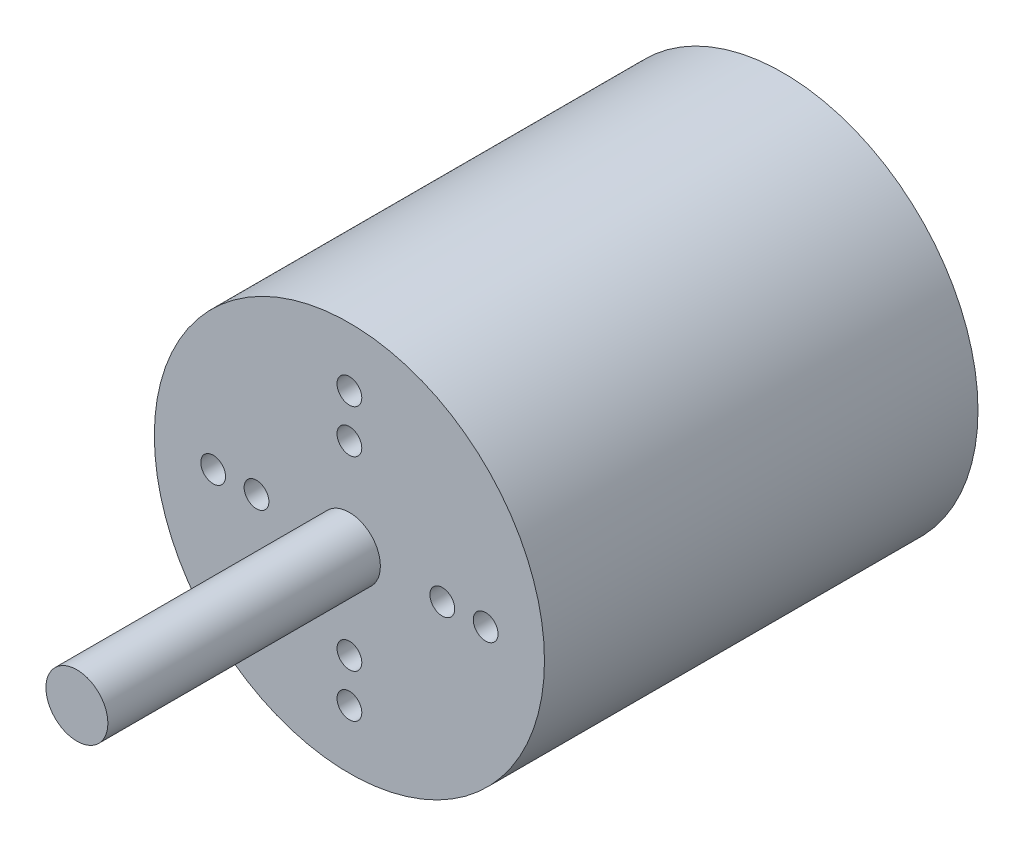
ISO-10303-21;
HEADER;
FILE_DESCRIPTION(('STEP AP214'),'2;1');
FILE_NAME('part.step','',(''),(''),'','','');
FILE_SCHEMA(('AUTOMOTIVE_DESIGN { 1 0 10303 214 1 1 1 1 }'));
ENDSEC;
DATA;
#1=APPLICATION_CONTEXT('core data for automotive mechanical design processes');
#2=APPLICATION_PROTOCOL_DEFINITION('international standard','automotive_design',2000,#1);
#3=PRODUCT_CONTEXT('',#1,'mechanical');
#4=PRODUCT('Part','Part','',(#3));
#5=PRODUCT_RELATED_PRODUCT_CATEGORY('part','',(#4));
#6=PRODUCT_DEFINITION_FORMATION('','',#4);
#7=PRODUCT_DEFINITION_CONTEXT('part definition',#1,'design');
#8=PRODUCT_DEFINITION('design','',#6,#7);
#9=PRODUCT_DEFINITION_SHAPE('','',#8);
#10=(LENGTH_UNIT() NAMED_UNIT(*) SI_UNIT(.MILLI.,.METRE.));
#11=(NAMED_UNIT(*) PLANE_ANGLE_UNIT() SI_UNIT($,.RADIAN.));
#12=(NAMED_UNIT(*) SI_UNIT($,.STERADIAN.) SOLID_ANGLE_UNIT());
#13=UNCERTAINTY_MEASURE_WITH_UNIT(LENGTH_MEASURE(1.E-05),#10,'distance_accuracy_value','');
#14=(GEOMETRIC_REPRESENTATION_CONTEXT(3) GLOBAL_UNCERTAINTY_ASSIGNED_CONTEXT((#13)) GLOBAL_UNIT_ASSIGNED_CONTEXT((#10,
#11,#12)) REPRESENTATION_CONTEXT('',''));
#15=CARTESIAN_POINT('',(0.,0.,0.));
#16=DIRECTION('',(0.,0.,1.));
#17=DIRECTION('',(1.,0.,0.));
#18=AXIS2_PLACEMENT_3D('',#15,#16,#17);
#19=CARTESIAN_POINT('',(0.,0.,-70.));
#20=DIRECTION('',(0.,0.,1.));
#21=DIRECTION('',(1.,0.,0.));
#22=AXIS2_PLACEMENT_3D('',#19,#20,#21);
#23=CYLINDRICAL_SURFACE('',#22,31.5);
#24=CARTESIAN_POINT('',(0.,0.,-70.));
#25=DIRECTION('',(0.,0.,1.));
#26=DIRECTION('',(1.,0.,0.));
#27=AXIS2_PLACEMENT_3D('',#24,#25,#26);
#28=CIRCLE('',#27,31.5);
#29=CARTESIAN_POINT('',(31.5,0.,-70.));
#30=VERTEX_POINT('',#29);
#31=EDGE_CURVE('E45',#30,#30,#28,.T.);
#32=ORIENTED_EDGE('',*,*,#31,.T.);
#33=EDGE_LOOP('',(#32));
#34=FACE_BOUND('',#33,.T.);
#35=CARTESIAN_POINT('',(0.,0.,0.));
#36=DIRECTION('',(0.,0.,1.));
#37=DIRECTION('',(1.,0.,0.));
#38=AXIS2_PLACEMENT_3D('',#35,#36,#37);
#39=CIRCLE('',#38,31.5);
#40=CARTESIAN_POINT('',(31.5,0.,0.));
#41=VERTEX_POINT('',#40);
#42=EDGE_CURVE('E40',#41,#41,#39,.T.);
#43=ORIENTED_EDGE('',*,*,#42,.F.);
#44=EDGE_LOOP('',(#43));
#45=FACE_BOUND('',#44,.T.);
#46=ADVANCED_FACE('F37',(#34,#45),#23,.T.);
#47=CARTESIAN_POINT('',(0.,0.,-70.));
#48=DIRECTION('',(0.,0.,1.));
#49=DIRECTION('',(1.,0.,0.));
#50=AXIS2_PLACEMENT_3D('',#47,#48,#49);
#51=PLANE('',#50);
#52=CARTESIAN_POINT('',(0.,11.,-70.));
#53=DIRECTION('',(0.,0.,-1.));
#54=DIRECTION('',(0.,-1.,0.));
#55=AXIS2_PLACEMENT_3D('',#52,#53,#54);
#56=CIRCLE('',#55,2.);
#57=CARTESIAN_POINT('',(0.,9.,-70.));
#58=VERTEX_POINT('',#57);
#59=EDGE_CURVE('E145',#58,#58,#56,.T.);
#60=ORIENTED_EDGE('',*,*,#59,.F.);
#61=EDGE_LOOP('',(#60));
#62=FACE_BOUND('',#61,.T.);
#63=CARTESIAN_POINT('',(-11.,0.,-70.));
#64=DIRECTION('',(0.,0.,-1.));
#65=DIRECTION('',(1.,0.,0.));
#66=AXIS2_PLACEMENT_3D('',#63,#64,#65);
#67=CIRCLE('',#66,2.);
#68=CARTESIAN_POINT('',(-9.,0.,-70.));
#69=VERTEX_POINT('',#68);
#70=EDGE_CURVE('E137',#69,#69,#67,.T.);
#71=ORIENTED_EDGE('',*,*,#70,.F.);
#72=EDGE_LOOP('',(#71));
#73=FACE_BOUND('',#72,.T.);
#74=CARTESIAN_POINT('',(1.15218884181823E-13,-11.,-70.));
#75=DIRECTION('',(0.,0.,-1.));
#76=DIRECTION('',(0.,1.,0.));
#77=AXIS2_PLACEMENT_3D('',#74,#75,#76);
#78=CIRCLE('',#77,2.);
#79=CARTESIAN_POINT('',(0.,-9.,-70.));
#80=VERTEX_POINT('',#79);
#81=EDGE_CURVE('E129',#80,#80,#78,.T.);
#82=ORIENTED_EDGE('',*,*,#81,.F.);
#83=EDGE_LOOP('',(#82));
#84=FACE_BOUND('',#83,.T.);
#85=CARTESIAN_POINT('',(11.,0.,-70.));
#86=DIRECTION('',(0.,0.,-1.));
#87=DIRECTION('',(-1.,0.,0.));
#88=AXIS2_PLACEMENT_3D('',#85,#86,#87);
#89=CIRCLE('',#88,2.);
#90=CARTESIAN_POINT('',(9.,0.,-70.));
#91=VERTEX_POINT('',#90);
#92=EDGE_CURVE('E57',#91,#91,#89,.T.);
#93=ORIENTED_EDGE('',*,*,#92,.F.);
#94=EDGE_LOOP('',(#93));
#95=FACE_BOUND('',#94,.T.);
#96=ORIENTED_EDGE('',*,*,#31,.F.);
#97=EDGE_LOOP('',(#96));
#98=FACE_BOUND('',#97,.T.);
#99=ADVANCED_FACE('F162',(#62,#73,#84,#95,#98),#51,.F.);
#100=CARTESIAN_POINT('',(0.,0.,0.));
#101=DIRECTION('',(0.,0.,1.));
#102=DIRECTION('',(1.,0.,0.));
#103=AXIS2_PLACEMENT_3D('',#100,#101,#102);
#104=PLANE('',#103);
#105=CARTESIAN_POINT('',(22.,2.30437768363647E-13,0.));
#106=DIRECTION('',(0.,0.,1.));
#107=DIRECTION('',(0.,-1.,0.));
#108=AXIS2_PLACEMENT_3D('',#105,#106,#107);
#109=CIRCLE('',#108,2.);
#110=CARTESIAN_POINT('',(22.,-1.99999999999977,0.));
#111=VERTEX_POINT('',#110);
#112=EDGE_CURVE('E89',#111,#111,#109,.T.);
#113=ORIENTED_EDGE('',*,*,#112,.F.);
#114=EDGE_LOOP('',(#113));
#115=FACE_BOUND('',#114,.T.);
#116=CARTESIAN_POINT('',(-22.,0.,0.));
#117=DIRECTION('',(0.,0.,1.));
#118=DIRECTION('',(0.,1.,0.));
#119=AXIS2_PLACEMENT_3D('',#116,#117,#118);
#120=CIRCLE('',#119,2.);
#121=CARTESIAN_POINT('',(-22.,1.99999999999992,0.));
#122=VERTEX_POINT('',#121);
#123=EDGE_CURVE('E108',#122,#122,#120,.T.);
#124=ORIENTED_EDGE('',*,*,#123,.F.);
#125=EDGE_LOOP('',(#124));
#126=FACE_BOUND('',#125,.T.);
#127=CARTESIAN_POINT('',(0.,-15.,0.));
#128=DIRECTION('',(0.,0.,1.));
#129=DIRECTION('',(-1.,0.,0.));
#130=AXIS2_PLACEMENT_3D('',#127,#128,#129);
#131=CIRCLE('',#130,2.);
#132=CARTESIAN_POINT('',(-2.,-15.,0.));
#133=VERTEX_POINT('',#132);
#134=EDGE_CURVE('E99',#133,#133,#131,.T.);
#135=ORIENTED_EDGE('',*,*,#134,.F.);
#136=EDGE_LOOP('',(#135));
#137=FACE_BOUND('',#136,.T.);
#138=CARTESIAN_POINT('',(0.,-22.,0.));
#139=DIRECTION('',(0.,0.,1.));
#140=DIRECTION('',(-1.,0.,0.));
#141=AXIS2_PLACEMENT_3D('',#138,#139,#140);
#142=CIRCLE('',#141,2.);
#143=CARTESIAN_POINT('',(-2.,-22.,0.));
#144=VERTEX_POINT('',#143);
#145=EDGE_CURVE('E122',#144,#144,#142,.T.);
#146=ORIENTED_EDGE('',*,*,#145,.F.);
#147=EDGE_LOOP('',(#146));
#148=FACE_BOUND('',#147,.T.);
#149=CARTESIAN_POINT('',(15.,1.57116660247941E-13,0.));
#150=DIRECTION('',(0.,0.,1.));
#151=DIRECTION('',(0.,-1.,0.));
#152=AXIS2_PLACEMENT_3D('',#149,#150,#151);
#153=CIRCLE('',#152,2.);
#154=CARTESIAN_POINT('',(15.,-1.99999999999984,0.));
#155=VERTEX_POINT('',#154);
#156=EDGE_CURVE('E98',#155,#155,#153,.T.);
#157=ORIENTED_EDGE('',*,*,#156,.F.);
#158=EDGE_LOOP('',(#157));
#159=FACE_BOUND('',#158,.T.);
#160=CARTESIAN_POINT('',(-15.,0.,0.));
#161=DIRECTION('',(0.,0.,1.));
#162=DIRECTION('',(0.,1.,0.));
#163=AXIS2_PLACEMENT_3D('',#160,#161,#162);
#164=CIRCLE('',#163,2.);
#165=CARTESIAN_POINT('',(-15.,1.99999999999995,0.));
#166=VERTEX_POINT('',#165);
#167=EDGE_CURVE('E81',#166,#166,#164,.T.);
#168=ORIENTED_EDGE('',*,*,#167,.F.);
#169=EDGE_LOOP('',(#168));
#170=FACE_BOUND('',#169,.T.);
#171=CARTESIAN_POINT('',(0.,15.,0.));
#172=DIRECTION('',(0.,0.,1.));
#173=DIRECTION('',(1.,0.,0.));
#174=AXIS2_PLACEMENT_3D('',#171,#172,#173);
#175=CIRCLE('',#174,2.);
#176=CARTESIAN_POINT('',(2.,15.,0.));
#177=VERTEX_POINT('',#176);
#178=EDGE_CURVE('E74',#177,#177,#175,.T.);
#179=ORIENTED_EDGE('',*,*,#178,.F.);
#180=EDGE_LOOP('',(#179));
#181=FACE_BOUND('',#180,.T.);
#182=CARTESIAN_POINT('',(0.,22.,0.));
#183=DIRECTION('',(0.,0.,1.));
#184=DIRECTION('',(1.,0.,0.));
#185=AXIS2_PLACEMENT_3D('',#182,#183,#184);
#186=CIRCLE('',#185,2.);
#187=CARTESIAN_POINT('',(2.,22.,0.));
#188=VERTEX_POINT('',#187);
#189=EDGE_CURVE('E65',#188,#188,#186,.T.);
#190=ORIENTED_EDGE('',*,*,#189,.F.);
#191=EDGE_LOOP('',(#190));
#192=FACE_BOUND('',#191,.T.);
#193=CARTESIAN_POINT('',(0.,0.,0.));
#194=DIRECTION('',(0.,0.,1.));
#195=DIRECTION('',(1.,0.,0.));
#196=AXIS2_PLACEMENT_3D('',#193,#194,#195);
#197=CIRCLE('',#196,5.);
#198=CARTESIAN_POINT('',(5.,0.,0.));
#199=VERTEX_POINT('',#198);
#200=EDGE_CURVE('E10',#199,#199,#197,.T.);
#201=ORIENTED_EDGE('',*,*,#200,.F.);
#202=EDGE_LOOP('',(#201));
#203=FACE_BOUND('',#202,.T.);
#204=ORIENTED_EDGE('',*,*,#42,.T.);
#205=EDGE_LOOP('',(#204));
#206=FACE_BOUND('',#205,.T.);
#207=ADVANCED_FACE('F165',(#115,#126,#137,#148,#159,#170,#181,#192,#203,#206),#104,.T.);
#208=CARTESIAN_POINT('',(0.,0.,44.));
#209=DIRECTION('',(0.,0.,-1.));
#210=DIRECTION('',(-1.,0.,0.));
#211=AXIS2_PLACEMENT_3D('',#208,#209,#210);
#212=CYLINDRICAL_SURFACE('',#211,5.);
#213=CARTESIAN_POINT('',(0.,0.,44.));
#214=DIRECTION('',(0.,0.,1.));
#215=DIRECTION('',(1.,0.,0.));
#216=AXIS2_PLACEMENT_3D('',#213,#214,#215);
#217=CIRCLE('',#216,5.);
#218=CARTESIAN_POINT('',(5.,0.,44.));
#219=VERTEX_POINT('',#218);
#220=EDGE_CURVE('E52',#219,#219,#217,.T.);
#221=ORIENTED_EDGE('',*,*,#220,.F.);
#222=EDGE_LOOP('',(#221));
#223=FACE_BOUND('',#222,.T.);
#224=ORIENTED_EDGE('',*,*,#200,.T.);
#225=EDGE_LOOP('',(#224));
#226=FACE_BOUND('',#225,.T.);
#227=ADVANCED_FACE('F182',(#223,#226),#212,.T.);
#228=CARTESIAN_POINT('',(0.,0.,44.));
#229=DIRECTION('',(0.,0.,1.));
#230=DIRECTION('',(1.,0.,0.));
#231=AXIS2_PLACEMENT_3D('',#228,#229,#230);
#232=PLANE('',#231);
#233=ORIENTED_EDGE('',*,*,#220,.T.);
#234=EDGE_LOOP('',(#233));
#235=FACE_BOUND('',#234,.T.);
#236=ADVANCED_FACE('F187',(#235),#232,.T.);
#237=CARTESIAN_POINT('',(11.,0.,-60.));
#238=DIRECTION('',(0.,0.,-1.));
#239=DIRECTION('',(-1.,0.,0.));
#240=AXIS2_PLACEMENT_3D('',#237,#238,#239);
#241=CYLINDRICAL_SURFACE('',#240,2.);
#242=CARTESIAN_POINT('',(11.,0.,-60.));
#243=DIRECTION('',(0.,0.,-1.));
#244=DIRECTION('',(-1.,0.,0.));
#245=AXIS2_PLACEMENT_3D('',#242,#243,#244);
#246=CIRCLE('',#245,2.);
#247=CARTESIAN_POINT('',(9.,0.,-60.));
#248=VERTEX_POINT('',#247);
#249=EDGE_CURVE('E56',#248,#248,#246,.T.);
#250=ORIENTED_EDGE('',*,*,#249,.F.);
#251=EDGE_LOOP('',(#250));
#252=FACE_BOUND('',#251,.T.);
#253=ORIENTED_EDGE('',*,*,#92,.T.);
#254=EDGE_LOOP('',(#253));
#255=FACE_BOUND('',#254,.T.);
#256=ADVANCED_FACE('F195',(#252,#255),#241,.F.);
#257=CARTESIAN_POINT('',(11.,0.,-60.));
#258=DIRECTION('',(0.,0.,-1.));
#259=DIRECTION('',(-1.,0.,0.));
#260=AXIS2_PLACEMENT_3D('',#257,#258,#259);
#261=PLANE('',#260);
#262=ORIENTED_EDGE('',*,*,#249,.T.);
#263=EDGE_LOOP('',(#262));
#264=FACE_BOUND('',#263,.T.);
#265=ADVANCED_FACE('F199',(#264),#261,.T.);
#266=CARTESIAN_POINT('',(0.,22.,-5.));
#267=DIRECTION('',(0.,0.,1.));
#268=DIRECTION('',(1.,0.,0.));
#269=AXIS2_PLACEMENT_3D('',#266,#267,#268);
#270=CYLINDRICAL_SURFACE('',#269,2.);
#271=CARTESIAN_POINT('',(0.,22.,-5.));
#272=DIRECTION('',(0.,0.,1.));
#273=DIRECTION('',(1.,0.,0.));
#274=AXIS2_PLACEMENT_3D('',#271,#272,#273);
#275=CIRCLE('',#274,2.);
#276=CARTESIAN_POINT('',(2.,22.,-5.));
#277=VERTEX_POINT('',#276);
#278=EDGE_CURVE('E69',#277,#277,#275,.T.);
#279=ORIENTED_EDGE('',*,*,#278,.F.);
#280=EDGE_LOOP('',(#279));
#281=FACE_BOUND('',#280,.T.);
#282=ORIENTED_EDGE('',*,*,#189,.T.);
#283=EDGE_LOOP('',(#282));
#284=FACE_BOUND('',#283,.T.);
#285=ADVANCED_FACE('F203',(#281,#284),#270,.F.);
#286=CARTESIAN_POINT('',(0.,22.,-5.));
#287=DIRECTION('',(0.,0.,1.));
#288=DIRECTION('',(1.,0.,0.));
#289=AXIS2_PLACEMENT_3D('',#286,#287,#288);
#290=PLANE('',#289);
#291=ORIENTED_EDGE('',*,*,#278,.T.);
#292=EDGE_LOOP('',(#291));
#293=FACE_BOUND('',#292,.T.);
#294=ADVANCED_FACE('F207',(#293),#290,.T.);
#295=CARTESIAN_POINT('',(0.,15.,-5.));
#296=DIRECTION('',(0.,0.,1.));
#297=DIRECTION('',(1.,0.,0.));
#298=AXIS2_PLACEMENT_3D('',#295,#296,#297);
#299=CYLINDRICAL_SURFACE('',#298,2.);
#300=CARTESIAN_POINT('',(0.,15.,-5.));
#301=DIRECTION('',(0.,0.,1.));
#302=DIRECTION('',(1.,0.,0.));
#303=AXIS2_PLACEMENT_3D('',#300,#301,#302);
#304=CIRCLE('',#303,2.);
#305=CARTESIAN_POINT('',(2.,15.,-5.));
#306=VERTEX_POINT('',#305);
#307=EDGE_CURVE('E61',#306,#306,#304,.T.);
#308=ORIENTED_EDGE('',*,*,#307,.F.);
#309=EDGE_LOOP('',(#308));
#310=FACE_BOUND('',#309,.T.);
#311=ORIENTED_EDGE('',*,*,#178,.T.);
#312=EDGE_LOOP('',(#311));
#313=FACE_BOUND('',#312,.T.);
#314=ADVANCED_FACE('F211',(#310,#313),#299,.F.);
#315=CARTESIAN_POINT('',(0.,15.,-5.));
#316=DIRECTION('',(0.,0.,1.));
#317=DIRECTION('',(1.,0.,0.));
#318=AXIS2_PLACEMENT_3D('',#315,#316,#317);
#319=PLANE('',#318);
#320=ORIENTED_EDGE('',*,*,#307,.T.);
#321=EDGE_LOOP('',(#320));
#322=FACE_BOUND('',#321,.T.);
#323=ADVANCED_FACE('F215',(#322),#319,.T.);
#324=CARTESIAN_POINT('',(-15.,0.,-5.));
#325=DIRECTION('',(0.,0.,1.));
#326=DIRECTION('',(1.,0.,0.));
#327=AXIS2_PLACEMENT_3D('',#324,#325,#326);
#328=CYLINDRICAL_SURFACE('',#327,2.);
#329=CARTESIAN_POINT('',(-15.,0.,-5.));
#330=DIRECTION('',(0.,0.,1.));
#331=DIRECTION('',(0.,1.,0.));
#332=AXIS2_PLACEMENT_3D('',#329,#330,#331);
#333=CIRCLE('',#332,2.);
#334=CARTESIAN_POINT('',(-15.,1.99999999999995,-5.));
#335=VERTEX_POINT('',#334);
#336=EDGE_CURVE('E70',#335,#335,#333,.T.);
#337=ORIENTED_EDGE('',*,*,#336,.F.);
#338=EDGE_LOOP('',(#337));
#339=FACE_BOUND('',#338,.T.);
#340=ORIENTED_EDGE('',*,*,#167,.T.);
#341=EDGE_LOOP('',(#340));
#342=FACE_BOUND('',#341,.T.);
#343=ADVANCED_FACE('F219',(#339,#342),#328,.F.);
#344=CARTESIAN_POINT('',(-15.,0.,-5.));
#345=DIRECTION('',(0.,0.,1.));
#346=DIRECTION('',(0.,1.,0.));
#347=AXIS2_PLACEMENT_3D('',#344,#345,#346);
#348=PLANE('',#347);
#349=ORIENTED_EDGE('',*,*,#336,.T.);
#350=EDGE_LOOP('',(#349));
#351=FACE_BOUND('',#350,.T.);
#352=ADVANCED_FACE('F223',(#351),#348,.T.);
#353=CARTESIAN_POINT('',(15.,1.57116660247941E-13,-5.));
#354=DIRECTION('',(0.,0.,1.));
#355=DIRECTION('',(1.,0.,0.));
#356=AXIS2_PLACEMENT_3D('',#353,#354,#355);
#357=CYLINDRICAL_SURFACE('',#356,2.);
#358=CARTESIAN_POINT('',(15.,1.57116660247941E-13,-5.));
#359=DIRECTION('',(0.,0.,1.));
#360=DIRECTION('',(0.,-1.,0.));
#361=AXIS2_PLACEMENT_3D('',#358,#359,#360);
#362=CIRCLE('',#361,2.);
#363=CARTESIAN_POINT('',(15.,-1.99999999999984,-5.));
#364=VERTEX_POINT('',#363);
#365=EDGE_CURVE('E118',#364,#364,#362,.T.);
#366=ORIENTED_EDGE('',*,*,#365,.F.);
#367=EDGE_LOOP('',(#366));
#368=FACE_BOUND('',#367,.T.);
#369=ORIENTED_EDGE('',*,*,#156,.T.);
#370=EDGE_LOOP('',(#369));
#371=FACE_BOUND('',#370,.T.);
#372=ADVANCED_FACE('F227',(#368,#371),#357,.F.);
#373=CARTESIAN_POINT('',(15.,1.57116660247941E-13,-5.));
#374=DIRECTION('',(0.,0.,1.));
#375=DIRECTION('',(0.,-1.,0.));
#376=AXIS2_PLACEMENT_3D('',#373,#374,#375);
#377=PLANE('',#376);
#378=ORIENTED_EDGE('',*,*,#365,.T.);
#379=EDGE_LOOP('',(#378));
#380=FACE_BOUND('',#379,.T.);
#381=ADVANCED_FACE('F257',(#380),#377,.T.);
#382=CARTESIAN_POINT('',(0.,-22.,-5.));
#383=DIRECTION('',(0.,0.,1.));
#384=DIRECTION('',(1.,0.,0.));
#385=AXIS2_PLACEMENT_3D('',#382,#383,#384);
#386=CYLINDRICAL_SURFACE('',#385,2.);
#387=CARTESIAN_POINT('',(0.,-22.,-5.));
#388=DIRECTION('',(0.,0.,1.));
#389=DIRECTION('',(-1.,0.,0.));
#390=AXIS2_PLACEMENT_3D('',#387,#388,#389);
#391=CIRCLE('',#390,2.);
#392=CARTESIAN_POINT('',(-2.,-22.,-5.));
#393=VERTEX_POINT('',#392);
#394=EDGE_CURVE('E104',#393,#393,#391,.T.);
#395=ORIENTED_EDGE('',*,*,#394,.F.);
#396=EDGE_LOOP('',(#395));
#397=FACE_BOUND('',#396,.T.);
#398=ORIENTED_EDGE('',*,*,#145,.T.);
#399=EDGE_LOOP('',(#398));
#400=FACE_BOUND('',#399,.T.);
#401=ADVANCED_FACE('F261',(#397,#400),#386,.F.);
#402=CARTESIAN_POINT('',(0.,-22.,-5.));
#403=DIRECTION('',(0.,0.,1.));
#404=DIRECTION('',(-1.,0.,0.));
#405=AXIS2_PLACEMENT_3D('',#402,#403,#404);
#406=PLANE('',#405);
#407=ORIENTED_EDGE('',*,*,#394,.T.);
#408=EDGE_LOOP('',(#407));
#409=FACE_BOUND('',#408,.T.);
#410=ADVANCED_FACE('F243',(#409),#406,.T.);
#411=CARTESIAN_POINT('',(0.,-15.,-5.));
#412=DIRECTION('',(0.,0.,1.));
#413=DIRECTION('',(1.,0.,0.));
#414=AXIS2_PLACEMENT_3D('',#411,#412,#413);
#415=CYLINDRICAL_SURFACE('',#414,2.);
#416=CARTESIAN_POINT('',(0.,-15.,-5.));
#417=DIRECTION('',(0.,0.,1.));
#418=DIRECTION('',(-1.,0.,0.));
#419=AXIS2_PLACEMENT_3D('',#416,#417,#418);
#420=CIRCLE('',#419,2.);
#421=CARTESIAN_POINT('',(-2.,-15.,-5.));
#422=VERTEX_POINT('',#421);
#423=EDGE_CURVE('E103',#422,#422,#420,.T.);
#424=ORIENTED_EDGE('',*,*,#423,.F.);
#425=EDGE_LOOP('',(#424));
#426=FACE_BOUND('',#425,.T.);
#427=ORIENTED_EDGE('',*,*,#134,.T.);
#428=EDGE_LOOP('',(#427));
#429=FACE_BOUND('',#428,.T.);
#430=ADVANCED_FACE('F239',(#426,#429),#415,.F.);
#431=CARTESIAN_POINT('',(0.,-15.,-5.));
#432=DIRECTION('',(0.,0.,1.));
#433=DIRECTION('',(-1.,0.,0.));
#434=AXIS2_PLACEMENT_3D('',#431,#432,#433);
#435=PLANE('',#434);
#436=ORIENTED_EDGE('',*,*,#423,.T.);
#437=EDGE_LOOP('',(#436));
#438=FACE_BOUND('',#437,.T.);
#439=ADVANCED_FACE('F242',(#438),#435,.T.);
#440=CARTESIAN_POINT('',(-22.,0.,-5.));
#441=DIRECTION('',(0.,0.,1.));
#442=DIRECTION('',(1.,0.,0.));
#443=AXIS2_PLACEMENT_3D('',#440,#441,#442);
#444=CYLINDRICAL_SURFACE('',#443,2.);
#445=CARTESIAN_POINT('',(-22.,0.,-5.));
#446=DIRECTION('',(0.,0.,1.));
#447=DIRECTION('',(0.,1.,0.));
#448=AXIS2_PLACEMENT_3D('',#445,#446,#447);
#449=CIRCLE('',#448,2.);
#450=CARTESIAN_POINT('',(-22.,1.99999999999992,-5.));
#451=VERTEX_POINT('',#450);
#452=EDGE_CURVE('E85',#451,#451,#449,.T.);
#453=ORIENTED_EDGE('',*,*,#452,.F.);
#454=EDGE_LOOP('',(#453));
#455=FACE_BOUND('',#454,.T.);
#456=ORIENTED_EDGE('',*,*,#123,.T.);
#457=EDGE_LOOP('',(#456));
#458=FACE_BOUND('',#457,.T.);
#459=ADVANCED_FACE('F247',(#455,#458),#444,.F.);
#460=CARTESIAN_POINT('',(-22.,0.,-5.));
#461=DIRECTION('',(0.,0.,1.));
#462=DIRECTION('',(0.,1.,0.));
#463=AXIS2_PLACEMENT_3D('',#460,#461,#462);
#464=PLANE('',#463);
#465=ORIENTED_EDGE('',*,*,#452,.T.);
#466=EDGE_LOOP('',(#465));
#467=FACE_BOUND('',#466,.T.);
#468=ADVANCED_FACE('F233',(#467),#464,.T.);
#469=CARTESIAN_POINT('',(22.,2.30437768363647E-13,-5.));
#470=DIRECTION('',(0.,0.,1.));
#471=DIRECTION('',(1.,0.,0.));
#472=AXIS2_PLACEMENT_3D('',#469,#470,#471);
#473=CYLINDRICAL_SURFACE('',#472,2.);
#474=CARTESIAN_POINT('',(22.,2.30437768363647E-13,-5.));
#475=DIRECTION('',(0.,0.,1.));
#476=DIRECTION('',(0.,-1.,0.));
#477=AXIS2_PLACEMENT_3D('',#474,#475,#476);
#478=CIRCLE('',#477,2.);
#479=CARTESIAN_POINT('',(22.,-1.99999999999977,-5.));
#480=VERTEX_POINT('',#479);
#481=EDGE_CURVE('E93',#480,#480,#478,.T.);
#482=ORIENTED_EDGE('',*,*,#481,.F.);
#483=EDGE_LOOP('',(#482));
#484=FACE_BOUND('',#483,.T.);
#485=ORIENTED_EDGE('',*,*,#112,.T.);
#486=EDGE_LOOP('',(#485));
#487=FACE_BOUND('',#486,.T.);
#488=ADVANCED_FACE('F229',(#484,#487),#473,.F.);
#489=CARTESIAN_POINT('',(22.,2.30437768363647E-13,-5.));
#490=DIRECTION('',(0.,0.,1.));
#491=DIRECTION('',(0.,-1.,0.));
#492=AXIS2_PLACEMENT_3D('',#489,#490,#491);
#493=PLANE('',#492);
#494=ORIENTED_EDGE('',*,*,#481,.T.);
#495=EDGE_LOOP('',(#494));
#496=FACE_BOUND('',#495,.T.);
#497=ADVANCED_FACE('F232',(#496),#493,.T.);
#498=CARTESIAN_POINT('',(1.15218884181823E-13,-11.,-60.));
#499=DIRECTION('',(0.,0.,-1.));
#500=DIRECTION('',(-1.,0.,0.));
#501=AXIS2_PLACEMENT_3D('',#498,#499,#500);
#502=CYLINDRICAL_SURFACE('',#501,2.);
#503=CARTESIAN_POINT('',(1.15218884181823E-13,-11.,-60.));
#504=DIRECTION('',(0.,0.,-1.));
#505=DIRECTION('',(0.,1.,0.));
#506=AXIS2_PLACEMENT_3D('',#503,#504,#505);
#507=CIRCLE('',#506,2.);
#508=CARTESIAN_POINT('',(0.,-9.,-60.));
#509=VERTEX_POINT('',#508);
#510=EDGE_CURVE('E133',#509,#509,#507,.T.);
#511=ORIENTED_EDGE('',*,*,#510,.F.);
#512=EDGE_LOOP('',(#511));
#513=FACE_BOUND('',#512,.T.);
#514=ORIENTED_EDGE('',*,*,#81,.T.);
#515=EDGE_LOOP('',(#514));
#516=FACE_BOUND('',#515,.T.);
#517=ADVANCED_FACE('F237',(#513,#516),#502,.F.);
#518=CARTESIAN_POINT('',(1.15218884181823E-13,-11.,-60.));
#519=DIRECTION('',(0.,0.,-1.));
#520=DIRECTION('',(0.,1.,0.));
#521=AXIS2_PLACEMENT_3D('',#518,#519,#520);
#522=PLANE('',#521);
#523=ORIENTED_EDGE('',*,*,#510,.T.);
#524=EDGE_LOOP('',(#523));
#525=FACE_BOUND('',#524,.T.);
#526=ADVANCED_FACE('F271',(#525),#522,.T.);
#527=CARTESIAN_POINT('',(-11.,0.,-60.));
#528=DIRECTION('',(0.,0.,-1.));
#529=DIRECTION('',(-1.,0.,0.));
#530=AXIS2_PLACEMENT_3D('',#527,#528,#529);
#531=CYLINDRICAL_SURFACE('',#530,2.);
#532=CARTESIAN_POINT('',(-11.,0.,-60.));
#533=DIRECTION('',(0.,0.,-1.));
#534=DIRECTION('',(1.,0.,0.));
#535=AXIS2_PLACEMENT_3D('',#532,#533,#534);
#536=CIRCLE('',#535,2.);
#537=CARTESIAN_POINT('',(-9.,0.,-60.));
#538=VERTEX_POINT('',#537);
#539=EDGE_CURVE('E141',#538,#538,#536,.T.);
#540=ORIENTED_EDGE('',*,*,#539,.F.);
#541=EDGE_LOOP('',(#540));
#542=FACE_BOUND('',#541,.T.);
#543=ORIENTED_EDGE('',*,*,#70,.T.);
#544=EDGE_LOOP('',(#543));
#545=FACE_BOUND('',#544,.T.);
#546=ADVANCED_FACE('F275',(#542,#545),#531,.F.);
#547=CARTESIAN_POINT('',(-11.,0.,-60.));
#548=DIRECTION('',(0.,0.,-1.));
#549=DIRECTION('',(1.,0.,0.));
#550=AXIS2_PLACEMENT_3D('',#547,#548,#549);
#551=PLANE('',#550);
#552=ORIENTED_EDGE('',*,*,#539,.T.);
#553=EDGE_LOOP('',(#552));
#554=FACE_BOUND('',#553,.T.);
#555=ADVANCED_FACE('F158',(#554),#551,.T.);
#556=CARTESIAN_POINT('',(0.,11.,-60.));
#557=DIRECTION('',(0.,0.,-1.));
#558=DIRECTION('',(-1.,0.,0.));
#559=AXIS2_PLACEMENT_3D('',#556,#557,#558);
#560=CYLINDRICAL_SURFACE('',#559,2.);
#561=CARTESIAN_POINT('',(0.,11.,-60.));
#562=DIRECTION('',(0.,0.,-1.));
#563=DIRECTION('',(0.,-1.,0.));
#564=AXIS2_PLACEMENT_3D('',#561,#562,#563);
#565=CIRCLE('',#564,2.);
#566=CARTESIAN_POINT('',(0.,9.,-60.));
#567=VERTEX_POINT('',#566);
#568=EDGE_CURVE('E94',#567,#567,#565,.T.);
#569=ORIENTED_EDGE('',*,*,#568,.F.);
#570=EDGE_LOOP('',(#569));
#571=FACE_BOUND('',#570,.T.);
#572=ORIENTED_EDGE('',*,*,#59,.T.);
#573=EDGE_LOOP('',(#572));
#574=FACE_BOUND('',#573,.T.);
#575=ADVANCED_FACE('F155',(#571,#574),#560,.F.);
#576=CARTESIAN_POINT('',(0.,11.,-60.));
#577=DIRECTION('',(0.,0.,-1.));
#578=DIRECTION('',(0.,-1.,0.));
#579=AXIS2_PLACEMENT_3D('',#576,#577,#578);
#580=PLANE('',#579);
#581=ORIENTED_EDGE('',*,*,#568,.T.);
#582=EDGE_LOOP('',(#581));
#583=FACE_BOUND('',#582,.T.);
#584=ADVANCED_FACE('F153',(#583),#580,.T.);
#585=CLOSED_SHELL('',(#46,#99,#207,#227,#236,#256,#265,#285,#294,#314,#323,#343,#352,#372,#381,
#401,#410,#430,#439,#459,#468,#488,#497,#517,#526,#546,#555,#575,#584));
#586=MANIFOLD_SOLID_BREP('B2',#585);
#587=ADVANCED_BREP_SHAPE_REPRESENTATION('',(#18,#586),#14);
#588=SHAPE_DEFINITION_REPRESENTATION(#9,#587);
ENDSEC;
END-ISO-10303-21;
